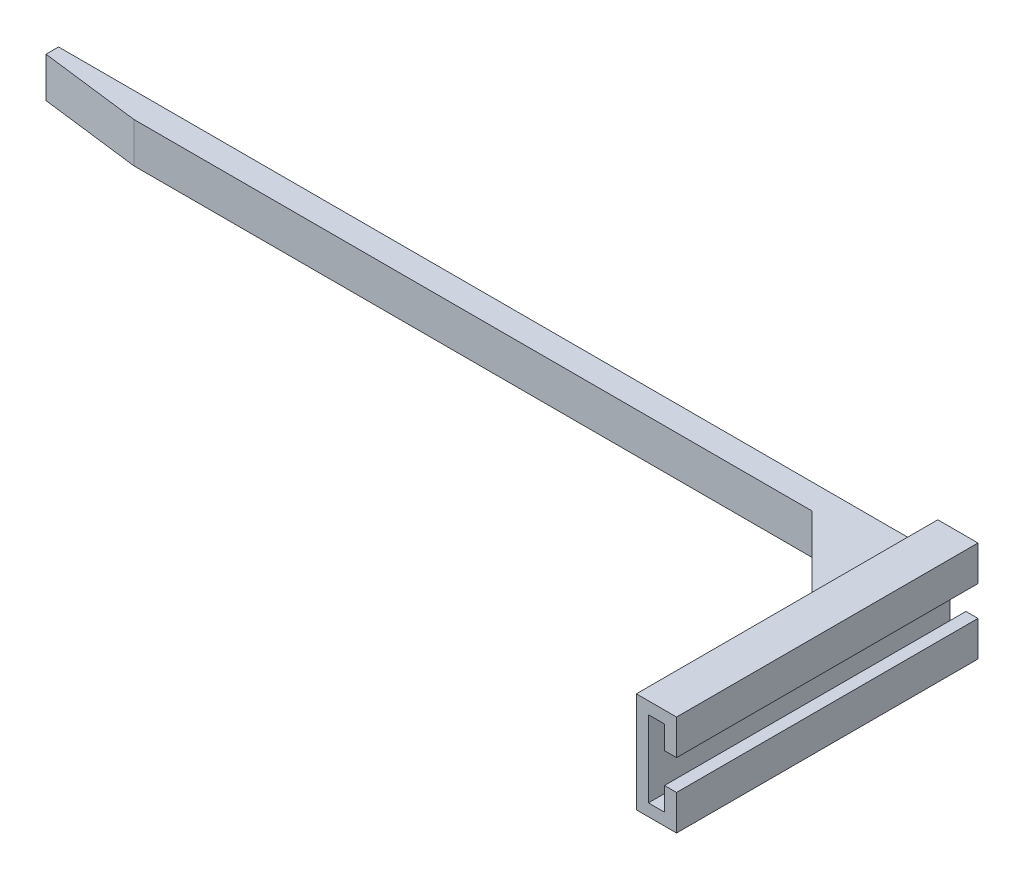
ISO-10303-21;
HEADER;
FILE_DESCRIPTION(('STEP AP214'),'2;1');
FILE_NAME('part.step','',(''),(''),'','','');
FILE_SCHEMA(('AUTOMOTIVE_DESIGN { 1 0 10303 214 1 1 1 1 }'));
ENDSEC;
DATA;
#1=APPLICATION_CONTEXT('core data for automotive mechanical design processes');
#2=APPLICATION_PROTOCOL_DEFINITION('international standard','automotive_design',2000,#1);
#3=PRODUCT_CONTEXT('',#1,'mechanical');
#4=PRODUCT('Part','Part','',(#3));
#5=PRODUCT_RELATED_PRODUCT_CATEGORY('part','',(#4));
#6=PRODUCT_DEFINITION_FORMATION('','',#4);
#7=PRODUCT_DEFINITION_CONTEXT('part definition',#1,'design');
#8=PRODUCT_DEFINITION('design','',#6,#7);
#9=PRODUCT_DEFINITION_SHAPE('','',#8);
#10=(LENGTH_UNIT() NAMED_UNIT(*) SI_UNIT(.MILLI.,.METRE.));
#11=(NAMED_UNIT(*) PLANE_ANGLE_UNIT() SI_UNIT($,.RADIAN.));
#12=(NAMED_UNIT(*) SI_UNIT($,.STERADIAN.) SOLID_ANGLE_UNIT());
#13=UNCERTAINTY_MEASURE_WITH_UNIT(LENGTH_MEASURE(1.E-05),#10,'distance_accuracy_value','');
#14=(GEOMETRIC_REPRESENTATION_CONTEXT(3) GLOBAL_UNCERTAINTY_ASSIGNED_CONTEXT((#13)) GLOBAL_UNIT_ASSIGNED_CONTEXT((#10,
#11,#12)) REPRESENTATION_CONTEXT('',''));
#15=CARTESIAN_POINT('',(0.,0.,0.));
#16=DIRECTION('',(0.,0.,1.));
#17=DIRECTION('',(1.,0.,0.));
#18=AXIS2_PLACEMENT_3D('',#15,#16,#17);
#19=CARTESIAN_POINT('',(-2.4,-2.4,60.));
#20=DIRECTION('',(-1.,0.,0.));
#21=DIRECTION('',(0.,0.,1.));
#22=AXIS2_PLACEMENT_3D('',#19,#20,#21);
#23=PLANE('',#22);
#24=DIRECTION('',(0.,-1.,0.));
#25=VECTOR('',#24,1.);
#26=CARTESIAN_POINT('',(-2.4,3.6,25.0000000000002));
#27=LINE('',#26,#25);
#28=CARTESIAN_POINT('',(-2.4,13.6,25.0000000000002));
#29=VERTEX_POINT('',#28);
#30=CARTESIAN_POINT('',(-2.4,1.6,25.0000000000002));
#31=VERTEX_POINT('',#30);
#32=EDGE_CURVE('E304',#29,#31,#27,.T.);
#33=ORIENTED_EDGE('',*,*,#32,.T.);
#34=DIRECTION('',(0.,0.,-1.));
#35=VECTOR('',#34,1.);
#36=CARTESIAN_POINT('',(-2.4,1.6,60.));
#37=LINE('',#36,#35);
#38=CARTESIAN_POINT('',(-2.4,1.6,0.));
#39=VERTEX_POINT('',#38);
#40=EDGE_CURVE('E319',#31,#39,#37,.T.);
#41=ORIENTED_EDGE('',*,*,#40,.T.);
#42=DIRECTION('',(0.,1.,0.));
#43=VECTOR('',#42,1.);
#44=CARTESIAN_POINT('',(-2.4,-2.4,0.));
#45=LINE('',#44,#43);
#46=CARTESIAN_POINT('',(-2.4,-2.4,0.));
#47=VERTEX_POINT('',#46);
#48=EDGE_CURVE('E262',#47,#39,#45,.T.);
#49=ORIENTED_EDGE('',*,*,#48,.F.);
#50=DIRECTION('',(0.,0.,-1.));
#51=VECTOR('',#50,1.);
#52=CARTESIAN_POINT('',(-2.4,-2.4,60.));
#53=LINE('',#52,#51);
#54=CARTESIAN_POINT('',(-2.4,-2.4,60.));
#55=VERTEX_POINT('',#54);
#56=EDGE_CURVE('E288',#55,#47,#53,.T.);
#57=ORIENTED_EDGE('',*,*,#56,.F.);
#58=DIRECTION('',(0.,1.,0.));
#59=VECTOR('',#58,1.);
#60=CARTESIAN_POINT('',(-2.4,-2.4,60.));
#61=LINE('',#60,#59);
#62=CARTESIAN_POINT('',(-2.4,17.6,60.));
#63=VERTEX_POINT('',#62);
#64=EDGE_CURVE('E225',#55,#63,#61,.T.);
#65=ORIENTED_EDGE('',*,*,#64,.T.);
#66=DIRECTION('',(0.,0.,-1.));
#67=VECTOR('',#66,1.);
#68=CARTESIAN_POINT('',(-2.4,17.6,60.));
#69=LINE('',#68,#67);
#70=CARTESIAN_POINT('',(-2.4,17.6,0.));
#71=VERTEX_POINT('',#70);
#72=EDGE_CURVE('E290',#63,#71,#69,.T.);
#73=ORIENTED_EDGE('',*,*,#72,.T.);
#74=CARTESIAN_POINT('',(-2.4,13.6,0.));
#75=VERTEX_POINT('',#74);
#76=EDGE_CURVE('E261',#75,#71,#45,.T.);
#77=ORIENTED_EDGE('',*,*,#76,.F.);
#78=DIRECTION('',(0.,0.,1.));
#79=VECTOR('',#78,1.);
#80=CARTESIAN_POINT('',(-2.4,13.6,25.0000000000002));
#81=LINE('',#80,#79);
#82=EDGE_CURVE('E316',#75,#29,#81,.T.);
#83=ORIENTED_EDGE('',*,*,#82,.T.);
#84=EDGE_LOOP('',(#33,#41,#49,#57,#65,#73,#77,#83));
#85=FACE_BOUND('',#84,.T.);
#86=ADVANCED_FACE('F41',(#85),#23,.T.);
#87=CARTESIAN_POINT('',(0.,0.,60.));
#88=DIRECTION('',(-1.,0.,0.));
#89=DIRECTION('',(0.,0.,1.));
#90=AXIS2_PLACEMENT_3D('',#87,#88,#89);
#91=PLANE('',#90);
#92=DIRECTION('',(0.,1.,0.));
#93=VECTOR('',#92,1.);
#94=CARTESIAN_POINT('',(0.,0.,0.));
#95=LINE('',#94,#93);
#96=CARTESIAN_POINT('',(0.,0.,0.));
#97=VERTEX_POINT('',#96);
#98=CARTESIAN_POINT('',(0.,15.2,0.));
#99=VERTEX_POINT('',#98);
#100=EDGE_CURVE('E242',#97,#99,#95,.T.);
#101=ORIENTED_EDGE('',*,*,#100,.T.);
#102=DIRECTION('',(0.,0.,-1.));
#103=VECTOR('',#102,1.);
#104=CARTESIAN_POINT('',(0.,15.2,60.));
#105=LINE('',#104,#103);
#106=CARTESIAN_POINT('',(0.,15.2,60.));
#107=VERTEX_POINT('',#106);
#108=EDGE_CURVE('E301',#107,#99,#105,.T.);
#109=ORIENTED_EDGE('',*,*,#108,.F.);
#110=DIRECTION('',(0.,1.,0.));
#111=VECTOR('',#110,1.);
#112=CARTESIAN_POINT('',(0.,0.,60.));
#113=LINE('',#112,#111);
#114=CARTESIAN_POINT('',(0.,0.,60.));
#115=VERTEX_POINT('',#114);
#116=EDGE_CURVE('E208',#115,#107,#113,.T.);
#117=ORIENTED_EDGE('',*,*,#116,.F.);
#118=DIRECTION('',(0.,0.,-1.));
#119=VECTOR('',#118,1.);
#120=CARTESIAN_POINT('',(0.,0.,60.));
#121=LINE('',#120,#119);
#122=EDGE_CURVE('E241',#115,#97,#121,.T.);
#123=ORIENTED_EDGE('',*,*,#122,.T.);
#124=EDGE_LOOP('',(#101,#109,#117,#123));
#125=FACE_BOUND('',#124,.T.);
#126=ADVANCED_FACE('F379',(#125),#91,.F.);
#127=CARTESIAN_POINT('',(0.,15.2,60.));
#128=DIRECTION('',(0.,1.,0.));
#129=DIRECTION('',(0.,0.,1.));
#130=AXIS2_PLACEMENT_3D('',#127,#128,#129);
#131=PLANE('',#130);
#132=DIRECTION('',(1.,0.,0.));
#133=VECTOR('',#132,1.);
#134=CARTESIAN_POINT('',(0.,15.2,0.));
#135=LINE('',#134,#133);
#136=CARTESIAN_POINT('',(3.2,15.2,0.));
#137=VERTEX_POINT('',#136);
#138=EDGE_CURVE('E245',#99,#137,#135,.T.);
#139=ORIENTED_EDGE('',*,*,#138,.T.);
#140=DIRECTION('',(0.,0.,-1.));
#141=VECTOR('',#140,1.);
#142=CARTESIAN_POINT('',(3.2,15.2,60.));
#143=LINE('',#142,#141);
#144=CARTESIAN_POINT('',(3.2,15.2,60.));
#145=VERTEX_POINT('',#144);
#146=EDGE_CURVE('E299',#145,#137,#143,.T.);
#147=ORIENTED_EDGE('',*,*,#146,.F.);
#148=DIRECTION('',(1.,0.,0.));
#149=VECTOR('',#148,1.);
#150=CARTESIAN_POINT('',(0.,15.2,60.));
#151=LINE('',#150,#149);
#152=EDGE_CURVE('E211',#107,#145,#151,.T.);
#153=ORIENTED_EDGE('',*,*,#152,.F.);
#154=ORIENTED_EDGE('',*,*,#108,.T.);
#155=EDGE_LOOP('',(#139,#147,#153,#154));
#156=FACE_BOUND('',#155,.T.);
#157=ADVANCED_FACE('F375',(#156),#131,.F.);
#158=CARTESIAN_POINT('',(3.2,10.6,60.));
#159=DIRECTION('',(-1.,0.,0.));
#160=DIRECTION('',(0.,0.,1.));
#161=AXIS2_PLACEMENT_3D('',#158,#159,#160);
#162=PLANE('',#161);
#163=DIRECTION('',(0.,1.,0.));
#164=VECTOR('',#163,1.);
#165=CARTESIAN_POINT('',(3.2,10.6,0.));
#166=LINE('',#165,#164);
#167=CARTESIAN_POINT('',(3.2,10.6,0.));
#168=VERTEX_POINT('',#167);
#169=EDGE_CURVE('E249',#168,#137,#166,.T.);
#170=ORIENTED_EDGE('',*,*,#169,.F.);
#171=DIRECTION('',(0.,0.,-1.));
#172=VECTOR('',#171,1.);
#173=CARTESIAN_POINT('',(3.2,10.6,60.));
#174=LINE('',#173,#172);
#175=CARTESIAN_POINT('',(3.2,10.6,60.));
#176=VERTEX_POINT('',#175);
#177=EDGE_CURVE('E297',#176,#168,#174,.T.);
#178=ORIENTED_EDGE('',*,*,#177,.F.);
#179=DIRECTION('',(0.,1.,0.));
#180=VECTOR('',#179,1.);
#181=CARTESIAN_POINT('',(3.2,10.6,60.));
#182=LINE('',#181,#180);
#183=EDGE_CURVE('E214',#176,#145,#182,.T.);
#184=ORIENTED_EDGE('',*,*,#183,.T.);
#185=ORIENTED_EDGE('',*,*,#146,.T.);
#186=EDGE_LOOP('',(#170,#178,#184,#185));
#187=FACE_BOUND('',#186,.T.);
#188=ADVANCED_FACE('F371',(#187),#162,.T.);
#189=CARTESIAN_POINT('',(5.6,10.6,60.));
#190=DIRECTION('',(0.,-1.,0.));
#191=DIRECTION('',(0.,0.,-1.));
#192=AXIS2_PLACEMENT_3D('',#189,#190,#191);
#193=PLANE('',#192);
#194=DIRECTION('',(-1.,0.,0.));
#195=VECTOR('',#194,1.);
#196=CARTESIAN_POINT('',(5.6,10.6,0.));
#197=LINE('',#196,#195);
#198=CARTESIAN_POINT('',(5.6,10.6,0.));
#199=VERTEX_POINT('',#198);
#200=EDGE_CURVE('E252',#199,#168,#197,.T.);
#201=ORIENTED_EDGE('',*,*,#200,.F.);
#202=DIRECTION('',(0.,0.,-1.));
#203=VECTOR('',#202,1.);
#204=CARTESIAN_POINT('',(5.6,10.6,60.));
#205=LINE('',#204,#203);
#206=CARTESIAN_POINT('',(5.6,10.6,60.));
#207=VERTEX_POINT('',#206);
#208=EDGE_CURVE('E295',#207,#199,#205,.T.);
#209=ORIENTED_EDGE('',*,*,#208,.F.);
#210=DIRECTION('',(-1.,0.,0.));
#211=VECTOR('',#210,1.);
#212=CARTESIAN_POINT('',(5.6,10.6,60.));
#213=LINE('',#212,#211);
#214=EDGE_CURVE('E217',#207,#176,#213,.T.);
#215=ORIENTED_EDGE('',*,*,#214,.T.);
#216=ORIENTED_EDGE('',*,*,#177,.T.);
#217=EDGE_LOOP('',(#201,#209,#215,#216));
#218=FACE_BOUND('',#217,.T.);
#219=ADVANCED_FACE('F368',(#218),#193,.T.);
#220=CARTESIAN_POINT('',(5.6,10.6,60.));
#221=DIRECTION('',(-1.,0.,0.));
#222=DIRECTION('',(0.,-1.,0.));
#223=AXIS2_PLACEMENT_3D('',#220,#221,#222);
#224=PLANE('',#223);
#225=DIRECTION('',(0.,1.,0.));
#226=VECTOR('',#225,1.);
#227=CARTESIAN_POINT('',(5.6,10.6,0.));
#228=LINE('',#227,#226);
#229=CARTESIAN_POINT('',(5.6,17.6,0.));
#230=VERTEX_POINT('',#229);
#231=EDGE_CURVE('E255',#199,#230,#228,.T.);
#232=ORIENTED_EDGE('',*,*,#231,.T.);
#233=DIRECTION('',(0.,0.,-1.));
#234=VECTOR('',#233,1.);
#235=CARTESIAN_POINT('',(5.6,17.6,60.));
#236=LINE('',#235,#234);
#237=CARTESIAN_POINT('',(5.6,17.6,60.));
#238=VERTEX_POINT('',#237);
#239=EDGE_CURVE('E293',#238,#230,#236,.T.);
#240=ORIENTED_EDGE('',*,*,#239,.F.);
#241=DIRECTION('',(0.,1.,0.));
#242=VECTOR('',#241,1.);
#243=CARTESIAN_POINT('',(5.6,10.6,60.));
#244=LINE('',#243,#242);
#245=EDGE_CURVE('E220',#207,#238,#244,.T.);
#246=ORIENTED_EDGE('',*,*,#245,.F.);
#247=ORIENTED_EDGE('',*,*,#208,.T.);
#248=EDGE_LOOP('',(#232,#240,#246,#247));
#249=FACE_BOUND('',#248,.T.);
#250=ADVANCED_FACE('F365',(#249),#224,.F.);
#251=CARTESIAN_POINT('',(-2.4,17.6,60.));
#252=DIRECTION('',(0.,1.,0.));
#253=DIRECTION('',(0.,0.,1.));
#254=AXIS2_PLACEMENT_3D('',#251,#252,#253);
#255=PLANE('',#254);
#256=DIRECTION('',(1.,0.,0.));
#257=VECTOR('',#256,1.);
#258=CARTESIAN_POINT('',(-2.4,17.6,0.));
#259=LINE('',#258,#257);
#260=EDGE_CURVE('E258',#71,#230,#259,.T.);
#261=ORIENTED_EDGE('',*,*,#260,.F.);
#262=ORIENTED_EDGE('',*,*,#72,.F.);
#263=DIRECTION('',(1.,0.,0.));
#264=VECTOR('',#263,1.);
#265=CARTESIAN_POINT('',(-2.4,17.6,60.));
#266=LINE('',#265,#264);
#267=EDGE_CURVE('E222',#63,#238,#266,.T.);
#268=ORIENTED_EDGE('',*,*,#267,.T.);
#269=ORIENTED_EDGE('',*,*,#239,.T.);
#270=EDGE_LOOP('',(#261,#262,#268,#269));
#271=FACE_BOUND('',#270,.T.);
#272=ADVANCED_FACE('F360',(#271),#255,.T.);
#273=CARTESIAN_POINT('',(-2.4,-2.4,60.));
#274=DIRECTION('',(0.,1.,0.));
#275=DIRECTION('',(-1.,0.,0.));
#276=AXIS2_PLACEMENT_3D('',#273,#274,#275);
#277=PLANE('',#276);
#278=DIRECTION('',(1.,0.,0.));
#279=VECTOR('',#278,1.);
#280=CARTESIAN_POINT('',(-2.4,-2.4,0.));
#281=LINE('',#280,#279);
#282=CARTESIAN_POINT('',(5.6,-2.4,0.));
#283=VERTEX_POINT('',#282);
#284=EDGE_CURVE('E265',#47,#283,#281,.T.);
#285=ORIENTED_EDGE('',*,*,#284,.T.);
#286=DIRECTION('',(0.,0.,-1.));
#287=VECTOR('',#286,1.);
#288=CARTESIAN_POINT('',(5.6,-2.4,60.));
#289=LINE('',#288,#287);
#290=CARTESIAN_POINT('',(5.6,-2.4,60.));
#291=VERTEX_POINT('',#290);
#292=EDGE_CURVE('E285',#291,#283,#289,.T.);
#293=ORIENTED_EDGE('',*,*,#292,.F.);
#294=DIRECTION('',(1.,0.,0.));
#295=VECTOR('',#294,1.);
#296=CARTESIAN_POINT('',(-2.4,-2.4,60.));
#297=LINE('',#296,#295);
#298=EDGE_CURVE('E228',#55,#291,#297,.T.);
#299=ORIENTED_EDGE('',*,*,#298,.F.);
#300=ORIENTED_EDGE('',*,*,#56,.T.);
#301=EDGE_LOOP('',(#285,#293,#299,#300));
#302=FACE_BOUND('',#301,.T.);
#303=ADVANCED_FACE('F400',(#302),#277,.F.);
#304=CARTESIAN_POINT('',(5.6,-2.4,60.));
#305=DIRECTION('',(-1.,0.,0.));
#306=DIRECTION('',(0.,-1.,0.));
#307=AXIS2_PLACEMENT_3D('',#304,#305,#306);
#308=PLANE('',#307);
#309=DIRECTION('',(0.,1.,0.));
#310=VECTOR('',#309,1.);
#311=CARTESIAN_POINT('',(5.6,-2.4,0.));
#312=LINE('',#311,#310);
#313=CARTESIAN_POINT('',(5.6,4.6,0.));
#314=VERTEX_POINT('',#313);
#315=EDGE_CURVE('E267',#283,#314,#312,.T.);
#316=ORIENTED_EDGE('',*,*,#315,.T.);
#317=DIRECTION('',(0.,0.,-1.));
#318=VECTOR('',#317,1.);
#319=CARTESIAN_POINT('',(5.6,4.6,60.));
#320=LINE('',#319,#318);
#321=CARTESIAN_POINT('',(5.6,4.6,60.));
#322=VERTEX_POINT('',#321);
#323=EDGE_CURVE('E283',#322,#314,#320,.T.);
#324=ORIENTED_EDGE('',*,*,#323,.F.);
#325=DIRECTION('',(0.,1.,0.));
#326=VECTOR('',#325,1.);
#327=CARTESIAN_POINT('',(5.6,-2.4,60.));
#328=LINE('',#327,#326);
#329=EDGE_CURVE('E230',#291,#322,#328,.T.);
#330=ORIENTED_EDGE('',*,*,#329,.F.);
#331=ORIENTED_EDGE('',*,*,#292,.T.);
#332=EDGE_LOOP('',(#316,#324,#330,#331));
#333=FACE_BOUND('',#332,.T.);
#334=ADVANCED_FACE('F396',(#333),#308,.F.);
#335=CARTESIAN_POINT('',(3.2,4.6,60.));
#336=DIRECTION('',(0.,1.,0.));
#337=DIRECTION('',(0.,0.,1.));
#338=AXIS2_PLACEMENT_3D('',#335,#336,#337);
#339=PLANE('',#338);
#340=DIRECTION('',(1.,0.,0.));
#341=VECTOR('',#340,1.);
#342=CARTESIAN_POINT('',(3.2,4.6,0.));
#343=LINE('',#342,#341);
#344=CARTESIAN_POINT('',(3.2,4.6,0.));
#345=VERTEX_POINT('',#344);
#346=EDGE_CURVE('E270',#345,#314,#343,.T.);
#347=ORIENTED_EDGE('',*,*,#346,.F.);
#348=DIRECTION('',(0.,0.,-1.));
#349=VECTOR('',#348,1.);
#350=CARTESIAN_POINT('',(3.2,4.6,60.));
#351=LINE('',#350,#349);
#352=CARTESIAN_POINT('',(3.2,4.6,60.));
#353=VERTEX_POINT('',#352);
#354=EDGE_CURVE('E281',#353,#345,#351,.T.);
#355=ORIENTED_EDGE('',*,*,#354,.F.);
#356=DIRECTION('',(1.,0.,0.));
#357=VECTOR('',#356,1.);
#358=CARTESIAN_POINT('',(3.2,4.6,60.));
#359=LINE('',#358,#357);
#360=EDGE_CURVE('E232',#353,#322,#359,.T.);
#361=ORIENTED_EDGE('',*,*,#360,.T.);
#362=ORIENTED_EDGE('',*,*,#323,.T.);
#363=EDGE_LOOP('',(#347,#355,#361,#362));
#364=FACE_BOUND('',#363,.T.);
#365=ADVANCED_FACE('F391',(#364),#339,.T.);
#366=CARTESIAN_POINT('',(3.2,0.,60.));
#367=DIRECTION('',(-1.,0.,0.));
#368=DIRECTION('',(0.,0.,1.));
#369=AXIS2_PLACEMENT_3D('',#366,#367,#368);
#370=PLANE('',#369);
#371=DIRECTION('',(0.,1.,0.));
#372=VECTOR('',#371,1.);
#373=CARTESIAN_POINT('',(3.2,0.,0.));
#374=LINE('',#373,#372);
#375=CARTESIAN_POINT('',(3.2,0.,0.));
#376=VERTEX_POINT('',#375);
#377=EDGE_CURVE('E273',#376,#345,#374,.T.);
#378=ORIENTED_EDGE('',*,*,#377,.F.);
#379=DIRECTION('',(0.,0.,-1.));
#380=VECTOR('',#379,1.);
#381=CARTESIAN_POINT('',(3.2,0.,60.));
#382=LINE('',#381,#380);
#383=CARTESIAN_POINT('',(3.2,0.,60.));
#384=VERTEX_POINT('',#383);
#385=EDGE_CURVE('E279',#384,#376,#382,.T.);
#386=ORIENTED_EDGE('',*,*,#385,.F.);
#387=DIRECTION('',(0.,1.,0.));
#388=VECTOR('',#387,1.);
#389=CARTESIAN_POINT('',(3.2,0.,60.));
#390=LINE('',#389,#388);
#391=EDGE_CURVE('E235',#384,#353,#390,.T.);
#392=ORIENTED_EDGE('',*,*,#391,.T.);
#393=ORIENTED_EDGE('',*,*,#354,.T.);
#394=EDGE_LOOP('',(#378,#386,#392,#393));
#395=FACE_BOUND('',#394,.T.);
#396=ADVANCED_FACE('F387',(#395),#370,.T.);
#397=CARTESIAN_POINT('',(0.,0.,60.));
#398=DIRECTION('',(0.,1.,0.));
#399=DIRECTION('',(0.,0.,1.));
#400=AXIS2_PLACEMENT_3D('',#397,#398,#399);
#401=PLANE('',#400);
#402=DIRECTION('',(1.,0.,0.));
#403=VECTOR('',#402,1.);
#404=CARTESIAN_POINT('',(0.,0.,0.));
#405=LINE('',#404,#403);
#406=EDGE_CURVE('E212',#97,#376,#405,.T.);
#407=ORIENTED_EDGE('',*,*,#406,.F.);
#408=ORIENTED_EDGE('',*,*,#122,.F.);
#409=DIRECTION('',(1.,0.,0.));
#410=VECTOR('',#409,1.);
#411=CARTESIAN_POINT('',(0.,0.,60.));
#412=LINE('',#411,#410);
#413=EDGE_CURVE('E238',#115,#384,#412,.T.);
#414=ORIENTED_EDGE('',*,*,#413,.T.);
#415=ORIENTED_EDGE('',*,*,#385,.T.);
#416=EDGE_LOOP('',(#407,#408,#414,#415));
#417=FACE_BOUND('',#416,.T.);
#418=ADVANCED_FACE('F382',(#417),#401,.T.);
#419=CARTESIAN_POINT('',(0.,0.,60.));
#420=DIRECTION('',(0.,0.,-1.));
#421=DIRECTION('',(-1.,0.,0.));
#422=AXIS2_PLACEMENT_3D('',#419,#420,#421);
#423=PLANE('',#422);
#424=ORIENTED_EDGE('',*,*,#116,.T.);
#425=ORIENTED_EDGE('',*,*,#152,.T.);
#426=ORIENTED_EDGE('',*,*,#183,.F.);
#427=ORIENTED_EDGE('',*,*,#214,.F.);
#428=ORIENTED_EDGE('',*,*,#245,.T.);
#429=ORIENTED_EDGE('',*,*,#267,.F.);
#430=ORIENTED_EDGE('',*,*,#64,.F.);
#431=ORIENTED_EDGE('',*,*,#298,.T.);
#432=ORIENTED_EDGE('',*,*,#329,.T.);
#433=ORIENTED_EDGE('',*,*,#360,.F.);
#434=ORIENTED_EDGE('',*,*,#391,.F.);
#435=ORIENTED_EDGE('',*,*,#413,.F.);
#436=EDGE_LOOP('',(#424,#425,#426,#427,#428,#429,#430,#431,#432,#433,#434,#435));
#437=FACE_BOUND('',#436,.T.);
#438=ADVANCED_FACE('F403',(#437),#423,.F.);
#439=CARTESIAN_POINT('',(0.,0.,0.));
#440=DIRECTION('',(0.,0.,-1.));
#441=DIRECTION('',(-1.,0.,0.));
#442=AXIS2_PLACEMENT_3D('',#439,#440,#441);
#443=PLANE('',#442);
#444=ORIENTED_EDGE('',*,*,#100,.F.);
#445=ORIENTED_EDGE('',*,*,#406,.T.);
#446=ORIENTED_EDGE('',*,*,#377,.T.);
#447=ORIENTED_EDGE('',*,*,#346,.T.);
#448=ORIENTED_EDGE('',*,*,#315,.F.);
#449=ORIENTED_EDGE('',*,*,#284,.F.);
#450=ORIENTED_EDGE('',*,*,#48,.T.);
#451=DIRECTION('',(-0.70710678118655,0.707106781186545,0.));
#452=VECTOR('',#451,1.);
#453=CARTESIAN_POINT('',(-4.40000000000001,3.6,0.));
#454=LINE('',#453,#452);
#455=CARTESIAN_POINT('',(-4.40000000000001,3.6,0.));
#456=VERTEX_POINT('',#455);
#457=EDGE_CURVE('E325',#39,#456,#454,.T.);
#458=ORIENTED_EDGE('',*,*,#457,.T.);
#459=DIRECTION('',(1.,0.,0.));
#460=VECTOR('',#459,1.);
#461=CARTESIAN_POINT('',(-177.4,3.6,0.));
#462=LINE('',#461,#460);
#463=CARTESIAN_POINT('',(-177.4,3.6,0.));
#464=VERTEX_POINT('',#463);
#465=EDGE_CURVE('E202',#464,#456,#462,.T.);
#466=ORIENTED_EDGE('',*,*,#465,.F.);
#467=DIRECTION('',(0.,-1.,0.));
#468=VECTOR('',#467,1.);
#469=CARTESIAN_POINT('',(-177.4,11.6,0.));
#470=LINE('',#469,#468);
#471=CARTESIAN_POINT('',(-177.4,11.6,0.));
#472=VERTEX_POINT('',#471);
#473=EDGE_CURVE('E200',#472,#464,#470,.T.);
#474=ORIENTED_EDGE('',*,*,#473,.F.);
#475=DIRECTION('',(1.,0.,0.));
#476=VECTOR('',#475,1.);
#477=CARTESIAN_POINT('',(-177.4,11.6,0.));
#478=LINE('',#477,#476);
#479=CARTESIAN_POINT('',(-4.39999999999999,11.6,0.));
#480=VERTEX_POINT('',#479);
#481=EDGE_CURVE('E246',#472,#480,#478,.T.);
#482=ORIENTED_EDGE('',*,*,#481,.T.);
#483=DIRECTION('',(-0.70710678118654,-0.707106781186555,0.));
#484=VECTOR('',#483,1.);
#485=CARTESIAN_POINT('',(-2.4,13.6,0.));
#486=LINE('',#485,#484);
#487=EDGE_CURVE('E11',#480,#75,#486,.F.);
#488=ORIENTED_EDGE('',*,*,#487,.T.);
#489=ORIENTED_EDGE('',*,*,#76,.T.);
#490=ORIENTED_EDGE('',*,*,#260,.T.);
#491=ORIENTED_EDGE('',*,*,#231,.F.);
#492=ORIENTED_EDGE('',*,*,#200,.T.);
#493=ORIENTED_EDGE('',*,*,#169,.T.);
#494=ORIENTED_EDGE('',*,*,#138,.F.);
#495=EDGE_LOOP('',(#444,#445,#446,#447,#448,#449,#450,#458,#466,#474,#482,#488,#489,#490,#491,
#492,#493,#494));
#496=FACE_BOUND('',#495,.T.);
#497=ADVANCED_FACE('F331',(#496),#443,.T.);
#498=CARTESIAN_POINT('',(-177.4,11.6,0.));
#499=DIRECTION('',(0.,1.,0.));
#500=DIRECTION('',(0.,0.,1.));
#501=AXIS2_PLACEMENT_3D('',#498,#499,#500);
#502=PLANE('',#501);
#503=DIRECTION('',(-0.707106781186544,0.,-0.707106781186551));
#504=VECTOR('',#503,1.);
#505=CARTESIAN_POINT('',(-2.4,11.6,25.0000000000002));
#506=LINE('',#505,#504);
#507=CARTESIAN_POINT('',(-22.3999999999999,11.6,5.));
#508=VERTEX_POINT('',#507);
#509=CARTESIAN_POINT('',(-4.39999999999999,11.6,23.0000000000001));
#510=VERTEX_POINT('',#509);
#511=EDGE_CURVE('E309',#508,#510,#506,.F.);
#512=ORIENTED_EDGE('',*,*,#511,.T.);
#513=DIRECTION('',(0.,0.,-1.));
#514=VECTOR('',#513,1.);
#515=CARTESIAN_POINT('',(-4.39999999999999,11.6,0.));
#516=LINE('',#515,#514);
#517=EDGE_CURVE('E57',#510,#480,#516,.T.);
#518=ORIENTED_EDGE('',*,*,#517,.T.);
#519=ORIENTED_EDGE('',*,*,#481,.F.);
#520=DIRECTION('',(0.,0.,1.));
#521=VECTOR('',#520,1.);
#522=CARTESIAN_POINT('',(-177.4,11.6,0.));
#523=LINE('',#522,#521);
#524=CARTESIAN_POINT('',(-177.4,11.6,2.5));
#525=VERTEX_POINT('',#524);
#526=EDGE_CURVE('E194',#472,#525,#523,.T.);
#527=ORIENTED_EDGE('',*,*,#526,.T.);
#528=DIRECTION('',(-0.992277876713668,0.,-0.124034734589209));
#529=VECTOR('',#528,1.);
#530=CARTESIAN_POINT('',(-177.4,11.6,2.5));
#531=LINE('',#530,#529);
#532=CARTESIAN_POINT('',(-157.4,11.6,5.));
#533=VERTEX_POINT('',#532);
#534=EDGE_CURVE('E180',#533,#525,#531,.T.);
#535=ORIENTED_EDGE('',*,*,#534,.F.);
#536=DIRECTION('',(1.,0.,0.));
#537=VECTOR('',#536,1.);
#538=CARTESIAN_POINT('',(-177.4,11.6,5.));
#539=LINE('',#538,#537);
#540=EDGE_CURVE('E191',#533,#508,#539,.T.);
#541=ORIENTED_EDGE('',*,*,#540,.T.);
#542=EDGE_LOOP('',(#512,#518,#519,#527,#535,#541));
#543=FACE_BOUND('',#542,.T.);
#544=ADVANCED_FACE('F190',(#543),#502,.T.);
#545=CARTESIAN_POINT('',(-177.4,3.6,0.));
#546=DIRECTION('',(0.,1.,0.));
#547=DIRECTION('',(0.,0.,1.));
#548=AXIS2_PLACEMENT_3D('',#545,#546,#547);
#549=PLANE('',#548);
#550=ORIENTED_EDGE('',*,*,#465,.T.);
#551=DIRECTION('',(0.,0.,1.));
#552=VECTOR('',#551,1.);
#553=CARTESIAN_POINT('',(-4.40000000000001,3.6,0.));
#554=LINE('',#553,#552);
#555=CARTESIAN_POINT('',(-4.4,3.6,23.0000000000001));
#556=VERTEX_POINT('',#555);
#557=EDGE_CURVE('E313',#456,#556,#554,.T.);
#558=ORIENTED_EDGE('',*,*,#557,.T.);
#559=DIRECTION('',(0.707106781186544,0.,0.707106781186551));
#560=VECTOR('',#559,1.);
#561=CARTESIAN_POINT('',(-102.399999999999,3.6,-75.));
#562=LINE('',#561,#560);
#563=CARTESIAN_POINT('',(-22.3999999999999,3.6,5.));
#564=VERTEX_POINT('',#563);
#565=EDGE_CURVE('E307',#556,#564,#562,.F.);
#566=ORIENTED_EDGE('',*,*,#565,.T.);
#567=DIRECTION('',(1.,0.,0.));
#568=VECTOR('',#567,1.);
#569=CARTESIAN_POINT('',(-177.4,3.6,5.));
#570=LINE('',#569,#568);
#571=CARTESIAN_POINT('',(-157.4,3.6,5.));
#572=VERTEX_POINT('',#571);
#573=EDGE_CURVE('E199',#572,#564,#570,.T.);
#574=ORIENTED_EDGE('',*,*,#573,.F.);
#575=DIRECTION('',(-0.992277876713668,0.,-0.124034734589209));
#576=VECTOR('',#575,1.);
#577=CARTESIAN_POINT('',(-177.707692307692,3.6,2.46153846153846));
#578=LINE('',#577,#576);
#579=CARTESIAN_POINT('',(-177.4,3.6,2.5));
#580=VERTEX_POINT('',#579);
#581=EDGE_CURVE('E183',#572,#580,#578,.T.);
#582=ORIENTED_EDGE('',*,*,#581,.T.);
#583=DIRECTION('',(0.,0.,1.));
#584=VECTOR('',#583,1.);
#585=CARTESIAN_POINT('',(-177.4,3.6,0.));
#586=LINE('',#585,#584);
#587=EDGE_CURVE('E204',#464,#580,#586,.T.);
#588=ORIENTED_EDGE('',*,*,#587,.F.);
#589=EDGE_LOOP('',(#550,#558,#566,#574,#582,#588));
#590=FACE_BOUND('',#589,.T.);
#591=ADVANCED_FACE('F340',(#590),#549,.F.);
#592=CARTESIAN_POINT('',(-177.4,11.6,5.));
#593=DIRECTION('',(0.,0.,1.));
#594=DIRECTION('',(0.,-1.,0.));
#595=AXIS2_PLACEMENT_3D('',#592,#593,#594);
#596=PLANE('',#595);
#597=DIRECTION('',(0.,1.,0.));
#598=VECTOR('',#597,1.);
#599=CARTESIAN_POINT('',(-157.4,-22.2,5.));
#600=LINE('',#599,#598);
#601=EDGE_CURVE('E177',#572,#533,#600,.T.);
#602=ORIENTED_EDGE('',*,*,#601,.F.);
#603=ORIENTED_EDGE('',*,*,#573,.T.);
#604=DIRECTION('',(0.,1.,0.));
#605=VECTOR('',#604,1.);
#606=CARTESIAN_POINT('',(-22.3999999999999,11.6,5.));
#607=LINE('',#606,#605);
#608=EDGE_CURVE('E198',#564,#508,#607,.T.);
#609=ORIENTED_EDGE('',*,*,#608,.T.);
#610=ORIENTED_EDGE('',*,*,#540,.F.);
#611=EDGE_LOOP('',(#602,#603,#609,#610));
#612=FACE_BOUND('',#611,.T.);
#613=ADVANCED_FACE('F196',(#612),#596,.T.);
#614=CARTESIAN_POINT('',(-177.4,0.,0.));
#615=DIRECTION('',(1.,0.,0.));
#616=DIRECTION('',(0.,0.,-1.));
#617=AXIS2_PLACEMENT_3D('',#614,#615,#616);
#618=PLANE('',#617);
#619=ORIENTED_EDGE('',*,*,#587,.T.);
#620=DIRECTION('',(0.,1.,0.));
#621=VECTOR('',#620,1.);
#622=CARTESIAN_POINT('',(-177.4,0.,2.5));
#623=LINE('',#622,#621);
#624=EDGE_CURVE('E311',#580,#525,#623,.T.);
#625=ORIENTED_EDGE('',*,*,#624,.T.);
#626=ORIENTED_EDGE('',*,*,#526,.F.);
#627=ORIENTED_EDGE('',*,*,#473,.T.);
#628=EDGE_LOOP('',(#619,#625,#626,#627));
#629=FACE_BOUND('',#628,.T.);
#630=ADVANCED_FACE('F347',(#629),#618,.F.);
#631=CARTESIAN_POINT('',(-2.4,-2.4,25.0000000000002));
#632=DIRECTION('',(-0.707106781186551,0.,0.707106781186544));
#633=DIRECTION('',(0.,1.,0.));
#634=AXIS2_PLACEMENT_3D('',#631,#632,#633);
#635=PLANE('',#634);
#636=ORIENTED_EDGE('',*,*,#511,.F.);
#637=ORIENTED_EDGE('',*,*,#608,.F.);
#638=ORIENTED_EDGE('',*,*,#565,.F.);
#639=DIRECTION('',(-0.577350269189625,0.577350269189621,-0.577350269189631));
#640=VECTOR('',#639,1.);
#641=CARTESIAN_POINT('',(-1.06666666666668,0.266666666666685,26.3333333333335));
#642=LINE('',#641,#640);
#643=EDGE_CURVE('E322',#556,#31,#642,.F.);
#644=ORIENTED_EDGE('',*,*,#643,.T.);
#645=ORIENTED_EDGE('',*,*,#32,.F.);
#646=DIRECTION('',(-0.57735026918962,-0.577350269189631,-0.577350269189626));
#647=VECTOR('',#646,1.);
#648=CARTESIAN_POINT('',(-7.73333333333334,8.26666666666658,19.6666666666668));
#649=LINE('',#648,#647);
#650=EDGE_CURVE('E50',#29,#510,#649,.T.);
#651=ORIENTED_EDGE('',*,*,#650,.T.);
#652=EDGE_LOOP('',(#636,#637,#638,#644,#645,#651));
#653=FACE_BOUND('',#652,.T.);
#654=ADVANCED_FACE('F344',(#653),#635,.T.);
#655=CARTESIAN_POINT('',(-177.4,-22.2,2.5));
#656=DIRECTION('',(0.124034734589209,0.,-0.992277876713668));
#657=DIRECTION('',(-0.992277876713668,0.,-0.124034734589209));
#658=AXIS2_PLACEMENT_3D('',#655,#656,#657);
#659=PLANE('',#658);
#660=ORIENTED_EDGE('',*,*,#601,.T.);
#661=ORIENTED_EDGE('',*,*,#534,.T.);
#662=ORIENTED_EDGE('',*,*,#624,.F.);
#663=ORIENTED_EDGE('',*,*,#581,.F.);
#664=EDGE_LOOP('',(#660,#661,#662,#663));
#665=FACE_BOUND('',#664,.T.);
#666=ADVANCED_FACE('F179',(#665),#659,.F.);
#667=CARTESIAN_POINT('',(-4.40000000000001,3.6,0.));
#668=DIRECTION('',(0.707106781186545,0.70710678118655,0.));
#669=DIRECTION('',(0.,0.,1.));
#670=AXIS2_PLACEMENT_3D('',#667,#668,#669);
#671=PLANE('',#670);
#672=ORIENTED_EDGE('',*,*,#457,.F.);
#673=ORIENTED_EDGE('',*,*,#40,.F.);
#674=ORIENTED_EDGE('',*,*,#643,.F.);
#675=ORIENTED_EDGE('',*,*,#557,.F.);
#676=EDGE_LOOP('',(#672,#673,#674,#675));
#677=FACE_BOUND('',#676,.T.);
#678=ADVANCED_FACE('F343',(#677),#671,.F.);
#679=CARTESIAN_POINT('',(-2.4,13.6,60.));
#680=DIRECTION('',(-0.707106781186555,0.70710678118654,0.));
#681=DIRECTION('',(0.,0.,-1.));
#682=AXIS2_PLACEMENT_3D('',#679,#680,#681);
#683=PLANE('',#682);
#684=ORIENTED_EDGE('',*,*,#487,.F.);
#685=ORIENTED_EDGE('',*,*,#517,.F.);
#686=ORIENTED_EDGE('',*,*,#650,.F.);
#687=ORIENTED_EDGE('',*,*,#82,.F.);
#688=EDGE_LOOP('',(#684,#685,#686,#687));
#689=FACE_BOUND('',#688,.T.);
#690=ADVANCED_FACE('F44',(#689),#683,.T.);
#691=CLOSED_SHELL('',(#86,#126,#157,#188,#219,#250,#272,#303,#334,#365,#396,#418,#438,#497,#544,
#591,#613,#630,#654,#666,#678,#690));
#692=MANIFOLD_SOLID_BREP('B2',#691);
#693=ADVANCED_BREP_SHAPE_REPRESENTATION('',(#18,#692),#14);
#694=SHAPE_DEFINITION_REPRESENTATION(#9,#693);
ENDSEC;
END-ISO-10303-21;
